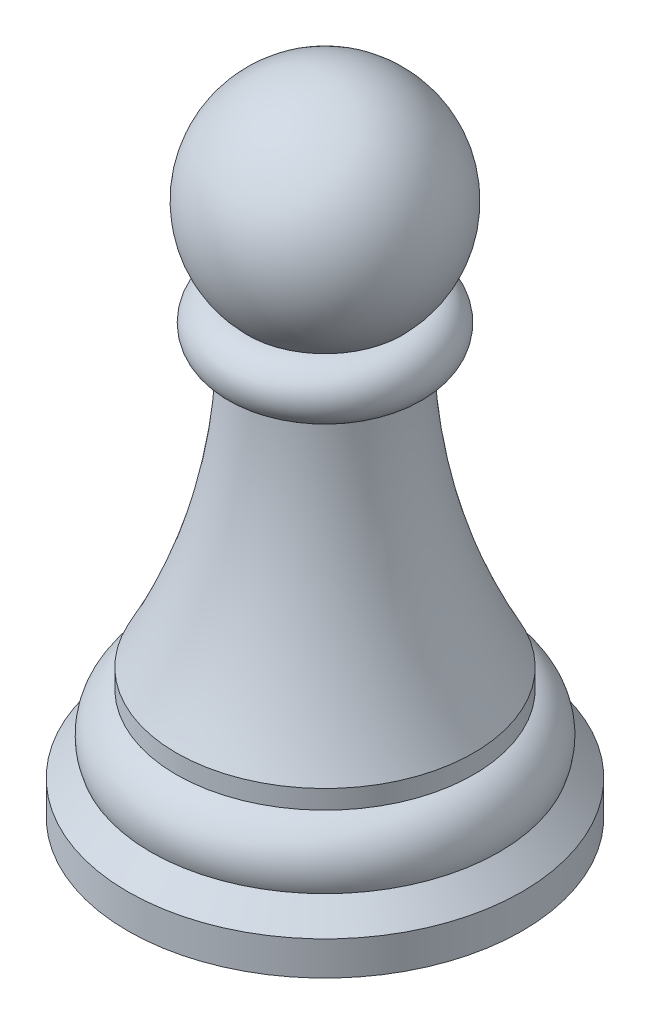
ISO-10303-21;
HEADER;
FILE_DESCRIPTION(('STEP AP214'),'2;1');
FILE_NAME('part.step','',(''),(''),'','','');
FILE_SCHEMA(('AUTOMOTIVE_DESIGN { 1 0 10303 214 1 1 1 1 }'));
ENDSEC;
DATA;
#1=APPLICATION_CONTEXT('core data for automotive mechanical design processes');
#2=APPLICATION_PROTOCOL_DEFINITION('international standard','automotive_design',2000,#1);
#3=PRODUCT_CONTEXT('',#1,'mechanical');
#4=PRODUCT('Part','Part','',(#3));
#5=PRODUCT_RELATED_PRODUCT_CATEGORY('part','',(#4));
#6=PRODUCT_DEFINITION_FORMATION('','',#4);
#7=PRODUCT_DEFINITION_CONTEXT('part definition',#1,'design');
#8=PRODUCT_DEFINITION('design','',#6,#7);
#9=PRODUCT_DEFINITION_SHAPE('','',#8);
#10=(LENGTH_UNIT() NAMED_UNIT(*) SI_UNIT(.MILLI.,.METRE.));
#11=(NAMED_UNIT(*) PLANE_ANGLE_UNIT() SI_UNIT($,.RADIAN.));
#12=(NAMED_UNIT(*) SI_UNIT($,.STERADIAN.) SOLID_ANGLE_UNIT());
#13=UNCERTAINTY_MEASURE_WITH_UNIT(LENGTH_MEASURE(1.E-05),#10,'distance_accuracy_value','');
#14=(GEOMETRIC_REPRESENTATION_CONTEXT(3) GLOBAL_UNCERTAINTY_ASSIGNED_CONTEXT((#13)) GLOBAL_UNIT_ASSIGNED_CONTEXT((#10,
#11,#12)) REPRESENTATION_CONTEXT('',''));
#15=CARTESIAN_POINT('',(0.,0.,0.));
#16=DIRECTION('',(0.,0.,1.));
#17=DIRECTION('',(1.,0.,0.));
#18=AXIS2_PLACEMENT_3D('',#15,#16,#17);
#19=CARTESIAN_POINT('',(0.,0.,0.));
#20=DIRECTION('',(0.,-1.,0.));
#21=DIRECTION('',(0.,0.,-1.));
#22=AXIS2_PLACEMENT_3D('',#19,#20,#21);
#23=PLANE('',#22);
#24=CARTESIAN_POINT('',(0.,0.,0.));
#25=DIRECTION('',(0.,-1.,0.));
#26=DIRECTION('',(0.,0.,-1.));
#27=AXIS2_PLACEMENT_3D('',#24,#25,#26);
#28=CIRCLE('',#27,6.35);
#29=CARTESIAN_POINT('',(0.,0.,-6.35));
#30=VERTEX_POINT('',#29);
#31=EDGE_CURVE('E10',#30,#30,#28,.T.);
#32=ORIENTED_EDGE('',*,*,#31,.T.);
#33=EDGE_LOOP('',(#32));
#34=FACE_BOUND('',#33,.T.);
#35=ADVANCED_FACE('F36',(#34),#23,.T.);
#36=CARTESIAN_POINT('',(0.,0.,0.));
#37=DIRECTION('',(0.,-1.,0.));
#38=DIRECTION('',(0.,0.,-1.));
#39=AXIS2_PLACEMENT_3D('',#36,#37,#38);
#40=CYLINDRICAL_SURFACE('',#39,6.35);
#41=CARTESIAN_POINT('',(0.,1.09388834471163,0.));
#42=DIRECTION('',(0.,-1.,0.));
#43=DIRECTION('',(0.,0.,-1.));
#44=AXIS2_PLACEMENT_3D('',#41,#42,#43);
#45=CIRCLE('',#44,6.35);
#46=CARTESIAN_POINT('',(0.,1.09388834471163,-6.35));
#47=VERTEX_POINT('',#46);
#48=EDGE_CURVE('E42',#47,#47,#45,.T.);
#49=ORIENTED_EDGE('',*,*,#48,.T.);
#50=EDGE_LOOP('',(#49));
#51=FACE_BOUND('',#50,.T.);
#52=ORIENTED_EDGE('',*,*,#31,.F.);
#53=EDGE_LOOP('',(#52));
#54=FACE_BOUND('',#53,.T.);
#55=ADVANCED_FACE('F88',(#51,#54),#40,.T.);
#56=CARTESIAN_POINT('',(0.,1.09388834471163,0.));
#57=DIRECTION('',(0.,-1.,0.));
#58=DIRECTION('',(0.,0.,-1.));
#59=AXIS2_PLACEMENT_3D('',#56,#57,#58);
#60=CONICAL_SURFACE('',#59,6.35,0.78539816339745);
#61=CARTESIAN_POINT('',(0.,1.83261563191787,0.));
#62=DIRECTION('',(0.,-1.,0.));
#63=DIRECTION('',(0.,0.,-1.));
#64=AXIS2_PLACEMENT_3D('',#61,#62,#63);
#65=CIRCLE('',#64,5.61127271279375);
#66=CARTESIAN_POINT('',(0.,1.83261563191787,-5.61127271279375));
#67=VERTEX_POINT('',#66);
#68=EDGE_CURVE('E46',#67,#67,#65,.T.);
#69=ORIENTED_EDGE('',*,*,#68,.T.);
#70=EDGE_LOOP('',(#69));
#71=FACE_BOUND('',#70,.T.);
#72=ORIENTED_EDGE('',*,*,#48,.F.);
#73=EDGE_LOOP('',(#72));
#74=FACE_BOUND('',#73,.T.);
#75=ADVANCED_FACE('F85',(#71,#74),#60,.T.);
#76=CARTESIAN_POINT('',(0.,2.29363921364172,0.));
#77=DIRECTION('',(0.,-1.,0.));
#78=DIRECTION('',(0.,0.,-1.));
#79=AXIS2_PLACEMENT_3D('',#76,#77,#78);
#80=TOROIDAL_SURFACE('',#79,4.32650197896103,1.36498299675071);
#81=CARTESIAN_POINT('',(0.,3.57840994747443,0.));
#82=DIRECTION('',(0.,-1.,0.));
#83=DIRECTION('',(0.,0.,-1.));
#84=AXIS2_PLACEMENT_3D('',#81,#82,#83);
#85=CIRCLE('',#84,4.7875255606849);
#86=CARTESIAN_POINT('',(0.,3.57840994747443,-4.7875255606849));
#87=VERTEX_POINT('',#86);
#88=EDGE_CURVE('E50',#87,#87,#85,.T.);
#89=ORIENTED_EDGE('',*,*,#88,.T.);
#90=EDGE_LOOP('',(#89));
#91=FACE_BOUND('',#90,.T.);
#92=ORIENTED_EDGE('',*,*,#68,.F.);
#93=EDGE_LOOP('',(#92));
#94=FACE_BOUND('',#93,.T.);
#95=ADVANCED_FACE('F81',(#91,#94),#80,.T.);
#96=CARTESIAN_POINT('',(0.,0.,0.));
#97=DIRECTION('',(0.,-1.,0.));
#98=DIRECTION('',(0.,0.,-1.));
#99=AXIS2_PLACEMENT_3D('',#96,#97,#98);
#100=CYLINDRICAL_SURFACE('',#99,4.7875255606849);
#101=CARTESIAN_POINT('',(0.,4.18396572324295,0.));
#102=DIRECTION('',(0.,-1.,0.));
#103=DIRECTION('',(0.,0.,-1.));
#104=AXIS2_PLACEMENT_3D('',#101,#102,#103);
#105=CIRCLE('',#104,4.7875255606849);
#106=CARTESIAN_POINT('',(0.,4.18396572324295,-4.7875255606849));
#107=VERTEX_POINT('',#106);
#108=EDGE_CURVE('E55',#107,#107,#105,.T.);
#109=ORIENTED_EDGE('',*,*,#108,.T.);
#110=EDGE_LOOP('',(#109));
#111=FACE_BOUND('',#110,.T.);
#112=ORIENTED_EDGE('',*,*,#88,.F.);
#113=EDGE_LOOP('',(#112));
#114=FACE_BOUND('',#113,.T.);
#115=ADVANCED_FACE('F76',(#111,#114),#100,.T.);
#116=CARTESIAN_POINT('',(4.7875255606849,4.18396572324295,0.));
#117=CARTESIAN_POINT('',(2.58341802148078,8.28686358640752,0.));
#118=CARTESIAN_POINT('',(2.48284931446934,12.9143363732467,0.));
#119=B_SPLINE_CURVE_WITH_KNOTS('',2,(#116,#117,#118),.UNSPECIFIED.,.F.,.F.,(3,3),(0.,1.),.UNSPECIFIED.);
#120=CARTESIAN_POINT('',(0.,0.,0.));
#121=DIRECTION('',(0.,-1.,0.));
#122=AXIS1_PLACEMENT('',#120,#121);
#123=SURFACE_OF_REVOLUTION('',#119,#122);
#124=CARTESIAN_POINT('',(0.,12.9143363732467,0.));
#125=DIRECTION('',(0.,-1.,0.));
#126=DIRECTION('',(0.,0.,-1.));
#127=AXIS2_PLACEMENT_3D('',#124,#125,#126);
#128=CIRCLE('',#127,2.48284931446934);
#129=CARTESIAN_POINT('',(0.,12.9143363732467,-2.48284931446934));
#130=VERTEX_POINT('',#129);
#131=EDGE_CURVE('E58',#130,#130,#128,.T.);
#132=ORIENTED_EDGE('',*,*,#131,.T.);
#133=EDGE_LOOP('',(#132));
#134=FACE_BOUND('',#133,.T.);
#135=ORIENTED_EDGE('',*,*,#108,.F.);
#136=EDGE_LOOP('',(#135));
#137=FACE_BOUND('',#136,.T.);
#138=ADVANCED_FACE('F71',(#134,#137),#123,.F.);
#139=CARTESIAN_POINT('',(0.,13.7973434739646,0.));
#140=DIRECTION('',(0.,-1.,0.));
#141=DIRECTION('',(0.,0.,-1.));
#142=AXIS2_PLACEMENT_3D('',#139,#140,#141);
#143=TOROIDAL_SURFACE('',#142,2.48284931446934,0.883007100717881);
#144=CARTESIAN_POINT('',(0.,14.6803505746825,0.));
#145=DIRECTION('',(0.,-1.,0.));
#146=DIRECTION('',(0.,0.,-1.));
#147=AXIS2_PLACEMENT_3D('',#144,#145,#146);
#148=CIRCLE('',#147,2.48284931446934);
#149=CARTESIAN_POINT('',(0.,14.6803505746825,-2.48284931446934));
#150=VERTEX_POINT('',#149);
#151=EDGE_CURVE('E61',#150,#150,#148,.T.);
#152=ORIENTED_EDGE('',*,*,#151,.T.);
#153=EDGE_LOOP('',(#152));
#154=FACE_BOUND('',#153,.T.);
#155=ORIENTED_EDGE('',*,*,#131,.F.);
#156=EDGE_LOOP('',(#155));
#157=FACE_BOUND('',#156,.T.);
#158=ADVANCED_FACE('F75',(#154,#157),#143,.T.);
#159=CARTESIAN_POINT('',(0.,17.1891300727242,0.));
#160=DIRECTION('',(0.,-1.,0.));
#161=DIRECTION('',(1.,0.,0.));
#162=AXIS2_PLACEMENT_3D('',#159,#160,#161);
#163=SPHERICAL_SURFACE('',#162,3.52966220595614);
#164=ORIENTED_EDGE('',*,*,#151,.F.);
#165=EDGE_LOOP('',(#164));
#166=FACE_BOUND('',#165,.T.);
#167=ADVANCED_FACE('F135',(#166),#163,.T.);
#168=CLOSED_SHELL('',(#35,#55,#75,#95,#115,#138,#158,#167));
#169=MANIFOLD_SOLID_BREP('B2',#168);
#170=ADVANCED_BREP_SHAPE_REPRESENTATION('',(#18,#169),#14);
#171=SHAPE_DEFINITION_REPRESENTATION(#9,#170);
ENDSEC;
END-ISO-10303-21;
